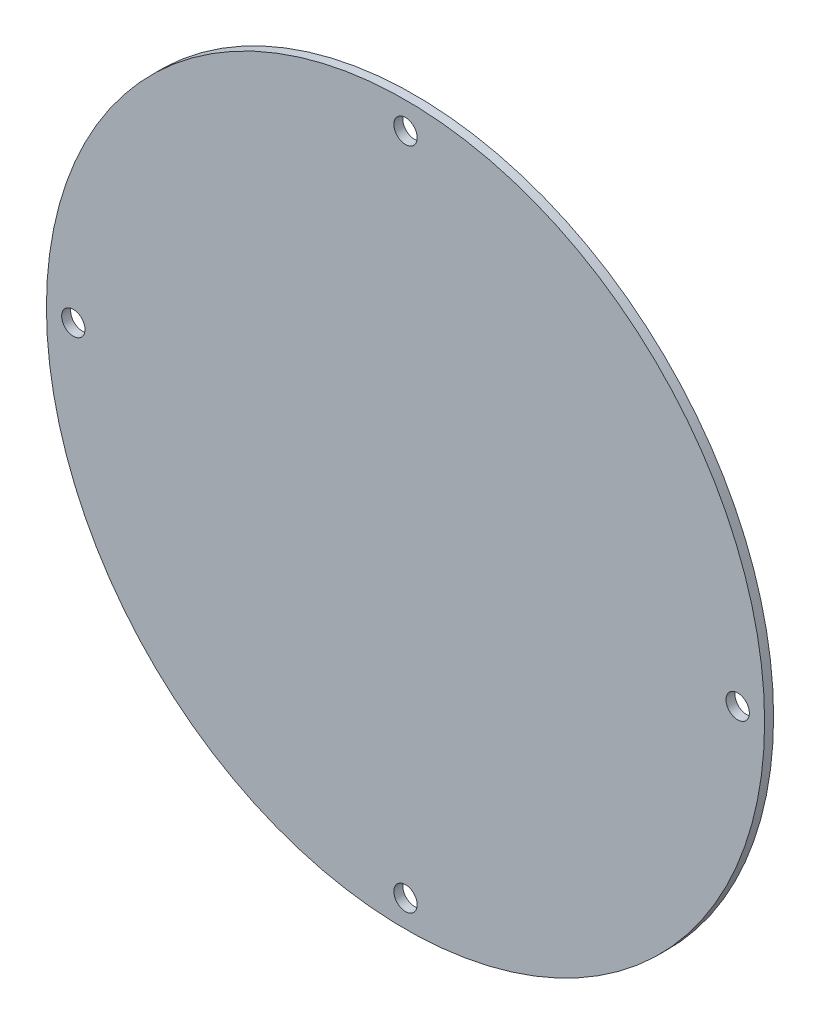
ISO-10303-21;
HEADER;
FILE_DESCRIPTION(('STEP AP214'),'2;1');
FILE_NAME('part.step','',(''),(''),'','','');
FILE_SCHEMA(('AUTOMOTIVE_DESIGN { 1 0 10303 214 1 1 1 1 }'));
ENDSEC;
DATA;
#1=APPLICATION_CONTEXT('core data for automotive mechanical design processes');
#2=APPLICATION_PROTOCOL_DEFINITION('international standard','automotive_design',2000,#1);
#3=PRODUCT_CONTEXT('',#1,'mechanical');
#4=PRODUCT('Part','Part','',(#3));
#5=PRODUCT_RELATED_PRODUCT_CATEGORY('part','',(#4));
#6=PRODUCT_DEFINITION_FORMATION('','',#4);
#7=PRODUCT_DEFINITION_CONTEXT('part definition',#1,'design');
#8=PRODUCT_DEFINITION('design','',#6,#7);
#9=PRODUCT_DEFINITION_SHAPE('','',#8);
#10=(LENGTH_UNIT() NAMED_UNIT(*) SI_UNIT(.MILLI.,.METRE.));
#11=(NAMED_UNIT(*) PLANE_ANGLE_UNIT() SI_UNIT($,.RADIAN.));
#12=(NAMED_UNIT(*) SI_UNIT($,.STERADIAN.) SOLID_ANGLE_UNIT());
#13=UNCERTAINTY_MEASURE_WITH_UNIT(LENGTH_MEASURE(1.E-05),#10,'distance_accuracy_value','');
#14=(GEOMETRIC_REPRESENTATION_CONTEXT(3) GLOBAL_UNCERTAINTY_ASSIGNED_CONTEXT((#13)) GLOBAL_UNIT_ASSIGNED_CONTEXT((#10,
#11,#12)) REPRESENTATION_CONTEXT('',''));
#15=CARTESIAN_POINT('',(0.,0.,0.));
#16=DIRECTION('',(0.,0.,1.));
#17=DIRECTION('',(1.,0.,0.));
#18=AXIS2_PLACEMENT_3D('',#15,#16,#17);
#19=CARTESIAN_POINT('',(0.,0.,1.));
#20=DIRECTION('',(0.,0.,-1.));
#21=DIRECTION('',(-1.,0.,0.));
#22=AXIS2_PLACEMENT_3D('',#19,#20,#21);
#23=CYLINDRICAL_SURFACE('',#22,40.);
#24=CARTESIAN_POINT('',(0.,0.,1.));
#25=DIRECTION('',(0.,0.,1.));
#26=DIRECTION('',(1.,0.,0.));
#27=AXIS2_PLACEMENT_3D('',#24,#25,#26);
#28=CIRCLE('',#27,40.);
#29=CARTESIAN_POINT('',(40.,0.,1.));
#30=VERTEX_POINT('',#29);
#31=EDGE_CURVE('E10',#30,#30,#28,.T.);
#32=ORIENTED_EDGE('',*,*,#31,.F.);
#33=EDGE_LOOP('',(#32));
#34=FACE_BOUND('',#33,.T.);
#35=CARTESIAN_POINT('',(0.,0.,0.));
#36=DIRECTION('',(0.,0.,1.));
#37=DIRECTION('',(1.,0.,0.));
#38=AXIS2_PLACEMENT_3D('',#35,#36,#37);
#39=CIRCLE('',#38,40.);
#40=CARTESIAN_POINT('',(40.,0.,0.));
#41=VERTEX_POINT('',#40);
#42=EDGE_CURVE('E36',#41,#41,#39,.T.);
#43=ORIENTED_EDGE('',*,*,#42,.T.);
#44=EDGE_LOOP('',(#43));
#45=FACE_BOUND('',#44,.T.);
#46=ADVANCED_FACE('F33',(#34,#45),#23,.T.);
#47=CARTESIAN_POINT('',(0.,0.,1.));
#48=DIRECTION('',(0.,0.,1.));
#49=DIRECTION('',(1.,0.,0.));
#50=AXIS2_PLACEMENT_3D('',#47,#48,#49);
#51=PLANE('',#50);
#52=CARTESIAN_POINT('',(37.,3.87554428611588E-13,1.));
#53=DIRECTION('',(0.,0.,-1.));
#54=DIRECTION('',(-1.,0.,0.));
#55=AXIS2_PLACEMENT_3D('',#52,#53,#54);
#56=CIRCLE('',#55,1.3);
#57=CARTESIAN_POINT('',(35.7,3.87554428611588E-13,1.));
#58=VERTEX_POINT('',#57);
#59=EDGE_CURVE('E62',#58,#58,#56,.T.);
#60=ORIENTED_EDGE('',*,*,#59,.T.);
#61=EDGE_LOOP('',(#60));
#62=FACE_BOUND('',#61,.T.);
#63=CARTESIAN_POINT('',(0.,-37.,1.));
#64=DIRECTION('',(0.,0.,-1.));
#65=DIRECTION('',(-1.,0.,0.));
#66=AXIS2_PLACEMENT_3D('',#63,#64,#65);
#67=CIRCLE('',#66,1.3);
#68=CARTESIAN_POINT('',(-1.3,-37.,1.));
#69=VERTEX_POINT('',#68);
#70=EDGE_CURVE('E56',#69,#69,#67,.T.);
#71=ORIENTED_EDGE('',*,*,#70,.T.);
#72=EDGE_LOOP('',(#71));
#73=FACE_BOUND('',#72,.T.);
#74=CARTESIAN_POINT('',(-37.,-1.29184809537196E-13,1.));
#75=DIRECTION('',(0.,0.,-1.));
#76=DIRECTION('',(-1.,0.,0.));
#77=AXIS2_PLACEMENT_3D('',#74,#75,#76);
#78=CIRCLE('',#77,1.3);
#79=CARTESIAN_POINT('',(-38.3,-1.29184809537196E-13,1.));
#80=VERTEX_POINT('',#79);
#81=EDGE_CURVE('E50',#80,#80,#78,.T.);
#82=ORIENTED_EDGE('',*,*,#81,.T.);
#83=EDGE_LOOP('',(#82));
#84=FACE_BOUND('',#83,.T.);
#85=CARTESIAN_POINT('',(0.,37.,1.));
#86=DIRECTION('',(0.,0.,-1.));
#87=DIRECTION('',(-1.,0.,0.));
#88=AXIS2_PLACEMENT_3D('',#85,#86,#87);
#89=CIRCLE('',#88,1.3);
#90=CARTESIAN_POINT('',(-1.3,37.,1.));
#91=VERTEX_POINT('',#90);
#92=EDGE_CURVE('E43',#91,#91,#89,.T.);
#93=ORIENTED_EDGE('',*,*,#92,.T.);
#94=EDGE_LOOP('',(#93));
#95=FACE_BOUND('',#94,.T.);
#96=ORIENTED_EDGE('',*,*,#31,.T.);
#97=EDGE_LOOP('',(#96));
#98=FACE_BOUND('',#97,.T.);
#99=ADVANCED_FACE('F75',(#62,#73,#84,#95,#98),#51,.T.);
#100=CARTESIAN_POINT('',(0.,0.,0.));
#101=DIRECTION('',(0.,0.,1.));
#102=DIRECTION('',(1.,0.,0.));
#103=AXIS2_PLACEMENT_3D('',#100,#101,#102);
#104=PLANE('',#103);
#105=CARTESIAN_POINT('',(37.,3.87554428611588E-13,0.));
#106=DIRECTION('',(0.,0.,-1.));
#107=DIRECTION('',(-1.,0.,0.));
#108=AXIS2_PLACEMENT_3D('',#105,#106,#107);
#109=CIRCLE('',#108,1.3);
#110=CARTESIAN_POINT('',(35.7,3.87554428611588E-13,0.));
#111=VERTEX_POINT('',#110);
#112=EDGE_CURVE('E65',#111,#111,#109,.T.);
#113=ORIENTED_EDGE('',*,*,#112,.F.);
#114=EDGE_LOOP('',(#113));
#115=FACE_BOUND('',#114,.T.);
#116=CARTESIAN_POINT('',(0.,-37.,0.));
#117=DIRECTION('',(0.,0.,-1.));
#118=DIRECTION('',(-1.,0.,0.));
#119=AXIS2_PLACEMENT_3D('',#116,#117,#118);
#120=CIRCLE('',#119,1.3);
#121=CARTESIAN_POINT('',(-1.3,-37.,0.));
#122=VERTEX_POINT('',#121);
#123=EDGE_CURVE('E59',#122,#122,#120,.T.);
#124=ORIENTED_EDGE('',*,*,#123,.F.);
#125=EDGE_LOOP('',(#124));
#126=FACE_BOUND('',#125,.T.);
#127=CARTESIAN_POINT('',(-37.,-1.29184809537196E-13,0.));
#128=DIRECTION('',(0.,0.,-1.));
#129=DIRECTION('',(-1.,0.,0.));
#130=AXIS2_PLACEMENT_3D('',#127,#128,#129);
#131=CIRCLE('',#130,1.3);
#132=CARTESIAN_POINT('',(-38.3,-1.29184809537196E-13,0.));
#133=VERTEX_POINT('',#132);
#134=EDGE_CURVE('E53',#133,#133,#131,.T.);
#135=ORIENTED_EDGE('',*,*,#134,.F.);
#136=EDGE_LOOP('',(#135));
#137=FACE_BOUND('',#136,.T.);
#138=CARTESIAN_POINT('',(0.,37.,0.));
#139=DIRECTION('',(0.,0.,-1.));
#140=DIRECTION('',(-1.,0.,0.));
#141=AXIS2_PLACEMENT_3D('',#138,#139,#140);
#142=CIRCLE('',#141,1.3);
#143=CARTESIAN_POINT('',(-1.3,37.,0.));
#144=VERTEX_POINT('',#143);
#145=EDGE_CURVE('E47',#144,#144,#142,.T.);
#146=ORIENTED_EDGE('',*,*,#145,.F.);
#147=EDGE_LOOP('',(#146));
#148=FACE_BOUND('',#147,.T.);
#149=ORIENTED_EDGE('',*,*,#42,.F.);
#150=EDGE_LOOP('',(#149));
#151=FACE_BOUND('',#150,.T.);
#152=ADVANCED_FACE('F71',(#115,#126,#137,#148,#151),#104,.F.);
#153=CARTESIAN_POINT('',(0.,37.,0.));
#154=DIRECTION('',(0.,0.,-1.));
#155=DIRECTION('',(-1.,0.,0.));
#156=AXIS2_PLACEMENT_3D('',#153,#154,#155);
#157=CYLINDRICAL_SURFACE('',#156,1.3);
#158=ORIENTED_EDGE('',*,*,#92,.F.);
#159=EDGE_LOOP('',(#158));
#160=FACE_BOUND('',#159,.T.);
#161=ORIENTED_EDGE('',*,*,#145,.T.);
#162=EDGE_LOOP('',(#161));
#163=FACE_BOUND('',#162,.T.);
#164=ADVANCED_FACE('F74',(#160,#163),#157,.F.);
#165=CARTESIAN_POINT('',(-37.,-1.29184809537196E-13,0.));
#166=DIRECTION('',(0.,0.,-1.));
#167=DIRECTION('',(-1.,0.,0.));
#168=AXIS2_PLACEMENT_3D('',#165,#166,#167);
#169=CYLINDRICAL_SURFACE('',#168,1.3);
#170=ORIENTED_EDGE('',*,*,#81,.F.);
#171=EDGE_LOOP('',(#170));
#172=FACE_BOUND('',#171,.T.);
#173=ORIENTED_EDGE('',*,*,#134,.T.);
#174=EDGE_LOOP('',(#173));
#175=FACE_BOUND('',#174,.T.);
#176=ADVANCED_FACE('F97',(#172,#175),#169,.F.);
#177=CARTESIAN_POINT('',(0.,-37.,0.));
#178=DIRECTION('',(0.,0.,-1.));
#179=DIRECTION('',(-1.,0.,0.));
#180=AXIS2_PLACEMENT_3D('',#177,#178,#179);
#181=CYLINDRICAL_SURFACE('',#180,1.3);
#182=ORIENTED_EDGE('',*,*,#70,.F.);
#183=EDGE_LOOP('',(#182));
#184=FACE_BOUND('',#183,.T.);
#185=ORIENTED_EDGE('',*,*,#123,.T.);
#186=EDGE_LOOP('',(#185));
#187=FACE_BOUND('',#186,.T.);
#188=ADVANCED_FACE('F101',(#184,#187),#181,.F.);
#189=CARTESIAN_POINT('',(37.,3.87554428611588E-13,0.));
#190=DIRECTION('',(0.,0.,-1.));
#191=DIRECTION('',(-1.,0.,0.));
#192=AXIS2_PLACEMENT_3D('',#189,#190,#191);
#193=CYLINDRICAL_SURFACE('',#192,1.3);
#194=ORIENTED_EDGE('',*,*,#59,.F.);
#195=EDGE_LOOP('',(#194));
#196=FACE_BOUND('',#195,.T.);
#197=ORIENTED_EDGE('',*,*,#112,.T.);
#198=EDGE_LOOP('',(#197));
#199=FACE_BOUND('',#198,.T.);
#200=ADVANCED_FACE('F69',(#196,#199),#193,.F.);
#201=CLOSED_SHELL('',(#46,#99,#152,#164,#176,#188,#200));
#202=MANIFOLD_SOLID_BREP('B2',#201);
#203=ADVANCED_BREP_SHAPE_REPRESENTATION('',(#18,#202),#14);
#204=SHAPE_DEFINITION_REPRESENTATION(#9,#203);
ENDSEC;
END-ISO-10303-21;
